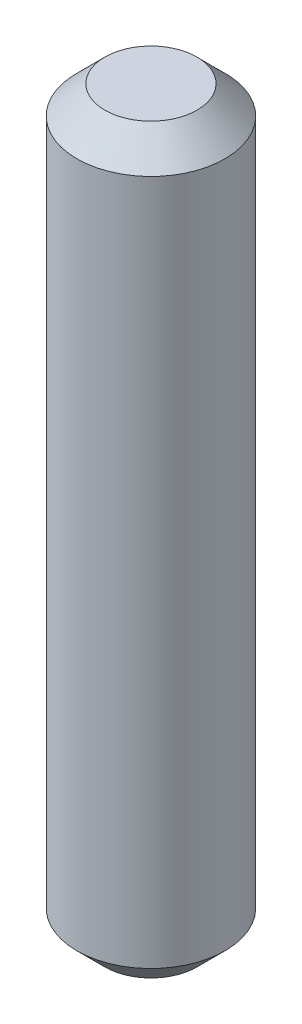
ISO-10303-21;
HEADER;
FILE_DESCRIPTION(('STEP AP214'),'2;1');
FILE_NAME('part.step','',(''),(''),'','','');
FILE_SCHEMA(('AUTOMOTIVE_DESIGN { 1 0 10303 214 1 1 1 1 }'));
ENDSEC;
DATA;
#1=APPLICATION_CONTEXT('core data for automotive mechanical design processes');
#2=APPLICATION_PROTOCOL_DEFINITION('international standard','automotive_design',2000,#1);
#3=PRODUCT_CONTEXT('',#1,'mechanical');
#4=PRODUCT('Part','Part','',(#3));
#5=PRODUCT_RELATED_PRODUCT_CATEGORY('part','',(#4));
#6=PRODUCT_DEFINITION_FORMATION('','',#4);
#7=PRODUCT_DEFINITION_CONTEXT('part definition',#1,'design');
#8=PRODUCT_DEFINITION('design','',#6,#7);
#9=PRODUCT_DEFINITION_SHAPE('','',#8);
#10=(LENGTH_UNIT() NAMED_UNIT(*) SI_UNIT(.MILLI.,.METRE.));
#11=(NAMED_UNIT(*) PLANE_ANGLE_UNIT() SI_UNIT($,.RADIAN.));
#12=(NAMED_UNIT(*) SI_UNIT($,.STERADIAN.) SOLID_ANGLE_UNIT());
#13=UNCERTAINTY_MEASURE_WITH_UNIT(LENGTH_MEASURE(1.E-05),#10,'distance_accuracy_value','');
#14=(GEOMETRIC_REPRESENTATION_CONTEXT(3) GLOBAL_UNCERTAINTY_ASSIGNED_CONTEXT((#13)) GLOBAL_UNIT_ASSIGNED_CONTEXT((#10,
#11,#12)) REPRESENTATION_CONTEXT('',''));
#15=CARTESIAN_POINT('',(0.,0.,0.));
#16=DIRECTION('',(0.,0.,1.));
#17=DIRECTION('',(1.,0.,0.));
#18=AXIS2_PLACEMENT_3D('',#15,#16,#17);
#19=CARTESIAN_POINT('',(0.,7.935,0.));
#20=DIRECTION('',(0.,-1.,0.));
#21=DIRECTION('',(0.,0.,-1.));
#22=AXIS2_PLACEMENT_3D('',#19,#20,#21);
#23=CYLINDRICAL_SURFACE('',#22,1.585);
#24=CARTESIAN_POINT('',(0.,-7.335,0.));
#25=DIRECTION('',(0.,1.,0.));
#26=DIRECTION('',(0.,0.,1.));
#27=AXIS2_PLACEMENT_3D('',#24,#25,#26);
#28=CIRCLE('',#27,1.585);
#29=CARTESIAN_POINT('',(0.,-7.335,1.585));
#30=VERTEX_POINT('',#29);
#31=EDGE_CURVE('E42',#30,#30,#28,.T.);
#32=ORIENTED_EDGE('',*,*,#31,.T.);
#33=EDGE_LOOP('',(#32));
#34=FACE_BOUND('',#33,.T.);
#35=CARTESIAN_POINT('',(0.,7.335,0.));
#36=DIRECTION('',(0.,1.,0.));
#37=DIRECTION('',(0.,0.,1.));
#38=AXIS2_PLACEMENT_3D('',#35,#36,#37);
#39=CIRCLE('',#38,1.585);
#40=CARTESIAN_POINT('',(0.,7.335,1.585));
#41=VERTEX_POINT('',#40);
#42=EDGE_CURVE('E46',#41,#41,#39,.F.);
#43=ORIENTED_EDGE('',*,*,#42,.T.);
#44=EDGE_LOOP('',(#43));
#45=FACE_BOUND('',#44,.T.);
#46=ADVANCED_FACE('F31',(#34,#45),#23,.T.);
#47=CARTESIAN_POINT('',(0.,7.935,0.));
#48=DIRECTION('',(0.,1.,0.));
#49=DIRECTION('',(0.,0.,1.));
#50=AXIS2_PLACEMENT_3D('',#47,#48,#49);
#51=PLANE('',#50);
#52=CARTESIAN_POINT('',(0.,7.935,0.));
#53=DIRECTION('',(0.,1.,0.));
#54=DIRECTION('',(0.,0.,1.));
#55=AXIS2_PLACEMENT_3D('',#52,#53,#54);
#56=CIRCLE('',#55,0.984999999999998);
#57=CARTESIAN_POINT('',(0.,7.935,0.984999999999998));
#58=VERTEX_POINT('',#57);
#59=EDGE_CURVE('E10',#58,#58,#56,.T.);
#60=ORIENTED_EDGE('',*,*,#59,.T.);
#61=EDGE_LOOP('',(#60));
#62=FACE_BOUND('',#61,.T.);
#63=ADVANCED_FACE('F62',(#62),#51,.T.);
#64=CARTESIAN_POINT('',(0.,-7.935,0.));
#65=DIRECTION('',(0.,1.,0.));
#66=DIRECTION('',(0.,0.,1.));
#67=AXIS2_PLACEMENT_3D('',#64,#65,#66);
#68=PLANE('',#67);
#69=CARTESIAN_POINT('',(0.,-7.935,0.));
#70=DIRECTION('',(0.,1.,0.));
#71=DIRECTION('',(0.,0.,1.));
#72=AXIS2_PLACEMENT_3D('',#69,#70,#71);
#73=CIRCLE('',#72,0.984999999999998);
#74=CARTESIAN_POINT('',(0.,-7.935,0.984999999999998));
#75=VERTEX_POINT('',#74);
#76=EDGE_CURVE('E38',#75,#75,#73,.F.);
#77=ORIENTED_EDGE('',*,*,#76,.T.);
#78=EDGE_LOOP('',(#77));
#79=FACE_BOUND('',#78,.T.);
#80=ADVANCED_FACE('F59',(#79),#68,.F.);
#81=CARTESIAN_POINT('',(0.,-7.335,0.));
#82=DIRECTION('',(0.,1.,0.));
#83=DIRECTION('',(0.,0.,1.));
#84=AXIS2_PLACEMENT_3D('',#81,#82,#83);
#85=CONICAL_SURFACE('',#84,1.585,0.785398163397447);
#86=ORIENTED_EDGE('',*,*,#76,.F.);
#87=EDGE_LOOP('',(#86));
#88=FACE_BOUND('',#87,.T.);
#89=ORIENTED_EDGE('',*,*,#31,.F.);
#90=EDGE_LOOP('',(#89));
#91=FACE_BOUND('',#90,.T.);
#92=ADVANCED_FACE('F55',(#88,#91),#85,.T.);
#93=CARTESIAN_POINT('',(0.,7.935,0.));
#94=DIRECTION('',(0.,-1.,0.));
#95=DIRECTION('',(0.,0.,-1.));
#96=AXIS2_PLACEMENT_3D('',#93,#94,#95);
#97=CONICAL_SURFACE('',#96,0.984999999999998,0.785398163397447);
#98=ORIENTED_EDGE('',*,*,#42,.F.);
#99=EDGE_LOOP('',(#98));
#100=FACE_BOUND('',#99,.T.);
#101=ORIENTED_EDGE('',*,*,#59,.F.);
#102=EDGE_LOOP('',(#101));
#103=FACE_BOUND('',#102,.T.);
#104=ADVANCED_FACE('F33',(#100,#103),#97,.T.);
#105=CLOSED_SHELL('',(#46,#63,#80,#92,#104));
#106=MANIFOLD_SOLID_BREP('B2',#105);
#107=ADVANCED_BREP_SHAPE_REPRESENTATION('',(#18,#106),#14);
#108=SHAPE_DEFINITION_REPRESENTATION(#9,#107);
ENDSEC;
END-ISO-10303-21;
